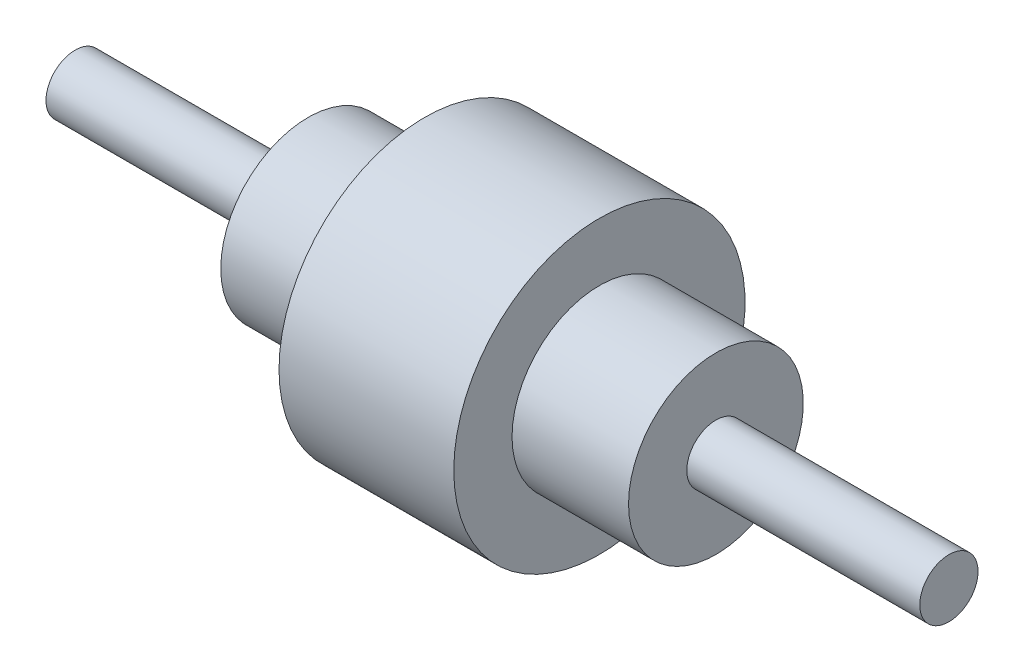
ISO-10303-21;
HEADER;
FILE_DESCRIPTION(('STEP AP214'),'2;1');
FILE_NAME('part.step','',(''),(''),'','','');
FILE_SCHEMA(('AUTOMOTIVE_DESIGN { 1 0 10303 214 1 1 1 1 }'));
ENDSEC;
DATA;
#1=APPLICATION_CONTEXT('core data for automotive mechanical design processes');
#2=APPLICATION_PROTOCOL_DEFINITION('international standard','automotive_design',2000,#1);
#3=PRODUCT_CONTEXT('',#1,'mechanical');
#4=PRODUCT('Part','Part','',(#3));
#5=PRODUCT_RELATED_PRODUCT_CATEGORY('part','',(#4));
#6=PRODUCT_DEFINITION_FORMATION('','',#4);
#7=PRODUCT_DEFINITION_CONTEXT('part definition',#1,'design');
#8=PRODUCT_DEFINITION('design','',#6,#7);
#9=PRODUCT_DEFINITION_SHAPE('','',#8);
#10=(LENGTH_UNIT() NAMED_UNIT(*) SI_UNIT(.MILLI.,.METRE.));
#11=(NAMED_UNIT(*) PLANE_ANGLE_UNIT() SI_UNIT($,.RADIAN.));
#12=(NAMED_UNIT(*) SI_UNIT($,.STERADIAN.) SOLID_ANGLE_UNIT());
#13=UNCERTAINTY_MEASURE_WITH_UNIT(LENGTH_MEASURE(1.E-05),#10,'distance_accuracy_value','');
#14=(GEOMETRIC_REPRESENTATION_CONTEXT(3) GLOBAL_UNCERTAINTY_ASSIGNED_CONTEXT((#13)) GLOBAL_UNIT_ASSIGNED_CONTEXT((#10,
#11,#12)) REPRESENTATION_CONTEXT('',''));
#15=CARTESIAN_POINT('',(0.,0.,0.));
#16=DIRECTION('',(0.,0.,1.));
#17=DIRECTION('',(1.,0.,0.));
#18=AXIS2_PLACEMENT_3D('',#15,#16,#17);
#19=CARTESIAN_POINT('',(30.,0.,-50.));
#20=DIRECTION('',(-1.,0.,0.));
#21=DIRECTION('',(0.,0.,1.));
#22=AXIS2_PLACEMENT_3D('',#19,#20,#21);
#23=PLANE('',#22);
#24=CARTESIAN_POINT('',(30.,0.,0.));
#25=DIRECTION('',(-1.,0.,0.));
#26=DIRECTION('',(0.,0.,1.));
#27=AXIS2_PLACEMENT_3D('',#24,#25,#26);
#28=CIRCLE('',#27,50.);
#29=CARTESIAN_POINT('',(30.,0.,50.));
#30=VERTEX_POINT('',#29);
#31=EDGE_CURVE('E10',#30,#30,#28,.T.);
#32=ORIENTED_EDGE('',*,*,#31,.F.);
#33=EDGE_LOOP('',(#32));
#34=FACE_BOUND('',#33,.T.);
#35=CARTESIAN_POINT('',(30.,0.,0.));
#36=DIRECTION('',(-1.,0.,0.));
#37=DIRECTION('',(0.,0.,1.));
#38=AXIS2_PLACEMENT_3D('',#35,#36,#37);
#39=CIRCLE('',#38,30.);
#40=CARTESIAN_POINT('',(30.,0.,30.));
#41=VERTEX_POINT('',#40);
#42=EDGE_CURVE('E65',#41,#41,#39,.T.);
#43=ORIENTED_EDGE('',*,*,#42,.T.);
#44=EDGE_LOOP('',(#43));
#45=FACE_BOUND('',#44,.T.);
#46=ADVANCED_FACE('F31',(#34,#45),#23,.F.);
#47=CARTESIAN_POINT('',(-169.638554216868,0.,0.));
#48=DIRECTION('',(-1.,0.,0.));
#49=DIRECTION('',(0.,0.,1.));
#50=AXIS2_PLACEMENT_3D('',#47,#48,#49);
#51=CYLINDRICAL_SURFACE('',#50,50.);
#52=CARTESIAN_POINT('',(-30.,0.,0.));
#53=DIRECTION('',(-1.,0.,0.));
#54=DIRECTION('',(0.,0.,1.));
#55=AXIS2_PLACEMENT_3D('',#52,#53,#54);
#56=CIRCLE('',#55,50.);
#57=CARTESIAN_POINT('',(-30.,0.,50.));
#58=VERTEX_POINT('',#57);
#59=EDGE_CURVE('E37',#58,#58,#56,.T.);
#60=ORIENTED_EDGE('',*,*,#59,.F.);
#61=EDGE_LOOP('',(#60));
#62=FACE_BOUND('',#61,.T.);
#63=ORIENTED_EDGE('',*,*,#31,.T.);
#64=EDGE_LOOP('',(#63));
#65=FACE_BOUND('',#64,.T.);
#66=ADVANCED_FACE('F99',(#62,#65),#51,.T.);
#67=CARTESIAN_POINT('',(-30.,0.,-50.));
#68=DIRECTION('',(1.,0.,0.));
#69=DIRECTION('',(0.,0.,-1.));
#70=AXIS2_PLACEMENT_3D('',#67,#68,#69);
#71=PLANE('',#70);
#72=CARTESIAN_POINT('',(-30.,0.,0.));
#73=DIRECTION('',(-1.,0.,0.));
#74=DIRECTION('',(0.,0.,1.));
#75=AXIS2_PLACEMENT_3D('',#72,#73,#74);
#76=CIRCLE('',#75,30.);
#77=CARTESIAN_POINT('',(-30.,0.,30.));
#78=VERTEX_POINT('',#77);
#79=EDGE_CURVE('E41',#78,#78,#76,.T.);
#80=ORIENTED_EDGE('',*,*,#79,.F.);
#81=EDGE_LOOP('',(#80));
#82=FACE_BOUND('',#81,.T.);
#83=ORIENTED_EDGE('',*,*,#59,.T.);
#84=EDGE_LOOP('',(#83));
#85=FACE_BOUND('',#84,.T.);
#86=ADVANCED_FACE('F104',(#82,#85),#71,.F.);
#87=CARTESIAN_POINT('',(-169.638554216868,0.,0.));
#88=DIRECTION('',(-1.,0.,0.));
#89=DIRECTION('',(0.,0.,1.));
#90=AXIS2_PLACEMENT_3D('',#87,#88,#89);
#91=CYLINDRICAL_SURFACE('',#90,30.);
#92=CARTESIAN_POINT('',(-70.,0.,0.));
#93=DIRECTION('',(-1.,0.,0.));
#94=DIRECTION('',(0.,0.,1.));
#95=AXIS2_PLACEMENT_3D('',#92,#93,#94);
#96=CIRCLE('',#95,30.);
#97=CARTESIAN_POINT('',(-70.,0.,30.));
#98=VERTEX_POINT('',#97);
#99=EDGE_CURVE('E45',#98,#98,#96,.T.);
#100=ORIENTED_EDGE('',*,*,#99,.F.);
#101=EDGE_LOOP('',(#100));
#102=FACE_BOUND('',#101,.T.);
#103=ORIENTED_EDGE('',*,*,#79,.T.);
#104=EDGE_LOOP('',(#103));
#105=FACE_BOUND('',#104,.T.);
#106=ADVANCED_FACE('F109',(#102,#105),#91,.T.);
#107=CARTESIAN_POINT('',(-70.,0.,-30.));
#108=DIRECTION('',(1.,0.,0.));
#109=DIRECTION('',(0.,0.,-1.));
#110=AXIS2_PLACEMENT_3D('',#107,#108,#109);
#111=PLANE('',#110);
#112=CARTESIAN_POINT('',(-70.,0.,0.));
#113=DIRECTION('',(-1.,0.,0.));
#114=DIRECTION('',(0.,0.,1.));
#115=AXIS2_PLACEMENT_3D('',#112,#113,#114);
#116=CIRCLE('',#115,10.);
#117=CARTESIAN_POINT('',(-70.,0.,10.));
#118=VERTEX_POINT('',#117);
#119=EDGE_CURVE('E50',#118,#118,#116,.T.);
#120=ORIENTED_EDGE('',*,*,#119,.F.);
#121=EDGE_LOOP('',(#120));
#122=FACE_BOUND('',#121,.T.);
#123=ORIENTED_EDGE('',*,*,#99,.T.);
#124=EDGE_LOOP('',(#123));
#125=FACE_BOUND('',#124,.T.);
#126=ADVANCED_FACE('F115',(#122,#125),#111,.F.);
#127=CARTESIAN_POINT('',(-169.638554216868,0.,0.));
#128=DIRECTION('',(-1.,0.,0.));
#129=DIRECTION('',(0.,0.,1.));
#130=AXIS2_PLACEMENT_3D('',#127,#128,#129);
#131=CYLINDRICAL_SURFACE('',#130,10.);
#132=CARTESIAN_POINT('',(-150.,0.,0.));
#133=DIRECTION('',(-1.,0.,0.));
#134=DIRECTION('',(0.,0.,1.));
#135=AXIS2_PLACEMENT_3D('',#132,#133,#134);
#136=CIRCLE('',#135,10.);
#137=CARTESIAN_POINT('',(-150.,0.,10.));
#138=VERTEX_POINT('',#137);
#139=EDGE_CURVE('E53',#138,#138,#136,.T.);
#140=ORIENTED_EDGE('',*,*,#139,.F.);
#141=EDGE_LOOP('',(#140));
#142=FACE_BOUND('',#141,.T.);
#143=ORIENTED_EDGE('',*,*,#119,.T.);
#144=EDGE_LOOP('',(#143));
#145=FACE_BOUND('',#144,.T.);
#146=ADVANCED_FACE('F95',(#142,#145),#131,.T.);
#147=CARTESIAN_POINT('',(-150.,0.,-10.));
#148=DIRECTION('',(1.,0.,0.));
#149=DIRECTION('',(0.,0.,-1.));
#150=AXIS2_PLACEMENT_3D('',#147,#148,#149);
#151=PLANE('',#150);
#152=ORIENTED_EDGE('',*,*,#139,.T.);
#153=EDGE_LOOP('',(#152));
#154=FACE_BOUND('',#153,.T.);
#155=ADVANCED_FACE('F90',(#154),#151,.F.);
#156=CARTESIAN_POINT('',(150.,0.,-10.));
#157=DIRECTION('',(-1.,0.,0.));
#158=DIRECTION('',(0.,0.,1.));
#159=AXIS2_PLACEMENT_3D('',#156,#157,#158);
#160=PLANE('',#159);
#161=CARTESIAN_POINT('',(150.,0.,0.));
#162=DIRECTION('',(-1.,0.,0.));
#163=DIRECTION('',(0.,0.,1.));
#164=AXIS2_PLACEMENT_3D('',#161,#162,#163);
#165=CIRCLE('',#164,10.);
#166=CARTESIAN_POINT('',(150.,0.,10.));
#167=VERTEX_POINT('',#166);
#168=EDGE_CURVE('E56',#167,#167,#165,.T.);
#169=ORIENTED_EDGE('',*,*,#168,.F.);
#170=EDGE_LOOP('',(#169));
#171=FACE_BOUND('',#170,.T.);
#172=ADVANCED_FACE('F85',(#171),#160,.F.);
#173=CARTESIAN_POINT('',(-169.638554216868,0.,0.));
#174=DIRECTION('',(-1.,0.,0.));
#175=DIRECTION('',(0.,0.,1.));
#176=AXIS2_PLACEMENT_3D('',#173,#174,#175);
#177=CYLINDRICAL_SURFACE('',#176,10.);
#178=CARTESIAN_POINT('',(70.,0.,0.));
#179=DIRECTION('',(-1.,0.,0.));
#180=DIRECTION('',(0.,0.,1.));
#181=AXIS2_PLACEMENT_3D('',#178,#179,#180);
#182=CIRCLE('',#181,10.);
#183=CARTESIAN_POINT('',(70.,0.,10.));
#184=VERTEX_POINT('',#183);
#185=EDGE_CURVE('E59',#184,#184,#182,.T.);
#186=ORIENTED_EDGE('',*,*,#185,.F.);
#187=EDGE_LOOP('',(#186));
#188=FACE_BOUND('',#187,.T.);
#189=ORIENTED_EDGE('',*,*,#168,.T.);
#190=EDGE_LOOP('',(#189));
#191=FACE_BOUND('',#190,.T.);
#192=ADVANCED_FACE('F79',(#188,#191),#177,.T.);
#193=CARTESIAN_POINT('',(70.,0.,-30.));
#194=DIRECTION('',(-1.,0.,0.));
#195=DIRECTION('',(0.,0.,1.));
#196=AXIS2_PLACEMENT_3D('',#193,#194,#195);
#197=PLANE('',#196);
#198=CARTESIAN_POINT('',(70.,0.,0.));
#199=DIRECTION('',(-1.,0.,0.));
#200=DIRECTION('',(0.,0.,1.));
#201=AXIS2_PLACEMENT_3D('',#198,#199,#200);
#202=CIRCLE('',#201,30.);
#203=CARTESIAN_POINT('',(70.,0.,30.));
#204=VERTEX_POINT('',#203);
#205=EDGE_CURVE('E62',#204,#204,#202,.T.);
#206=ORIENTED_EDGE('',*,*,#205,.F.);
#207=EDGE_LOOP('',(#206));
#208=FACE_BOUND('',#207,.T.);
#209=ORIENTED_EDGE('',*,*,#185,.T.);
#210=EDGE_LOOP('',(#209));
#211=FACE_BOUND('',#210,.T.);
#212=ADVANCED_FACE('F73',(#208,#211),#197,.F.);
#213=CARTESIAN_POINT('',(-169.638554216868,0.,0.));
#214=DIRECTION('',(-1.,0.,0.));
#215=DIRECTION('',(0.,0.,1.));
#216=AXIS2_PLACEMENT_3D('',#213,#214,#215);
#217=CYLINDRICAL_SURFACE('',#216,30.);
#218=ORIENTED_EDGE('',*,*,#42,.F.);
#219=EDGE_LOOP('',(#218));
#220=FACE_BOUND('',#219,.T.);
#221=ORIENTED_EDGE('',*,*,#205,.T.);
#222=EDGE_LOOP('',(#221));
#223=FACE_BOUND('',#222,.T.);
#224=ADVANCED_FACE('F70',(#220,#223),#217,.T.);
#225=CLOSED_SHELL('',(#46,#66,#86,#106,#126,#146,#155,#172,#192,#212,#224));
#226=MANIFOLD_SOLID_BREP('B2',#225);
#227=ADVANCED_BREP_SHAPE_REPRESENTATION('',(#18,#226),#14);
#228=SHAPE_DEFINITION_REPRESENTATION(#9,#227);
ENDSEC;
END-ISO-10303-21;
